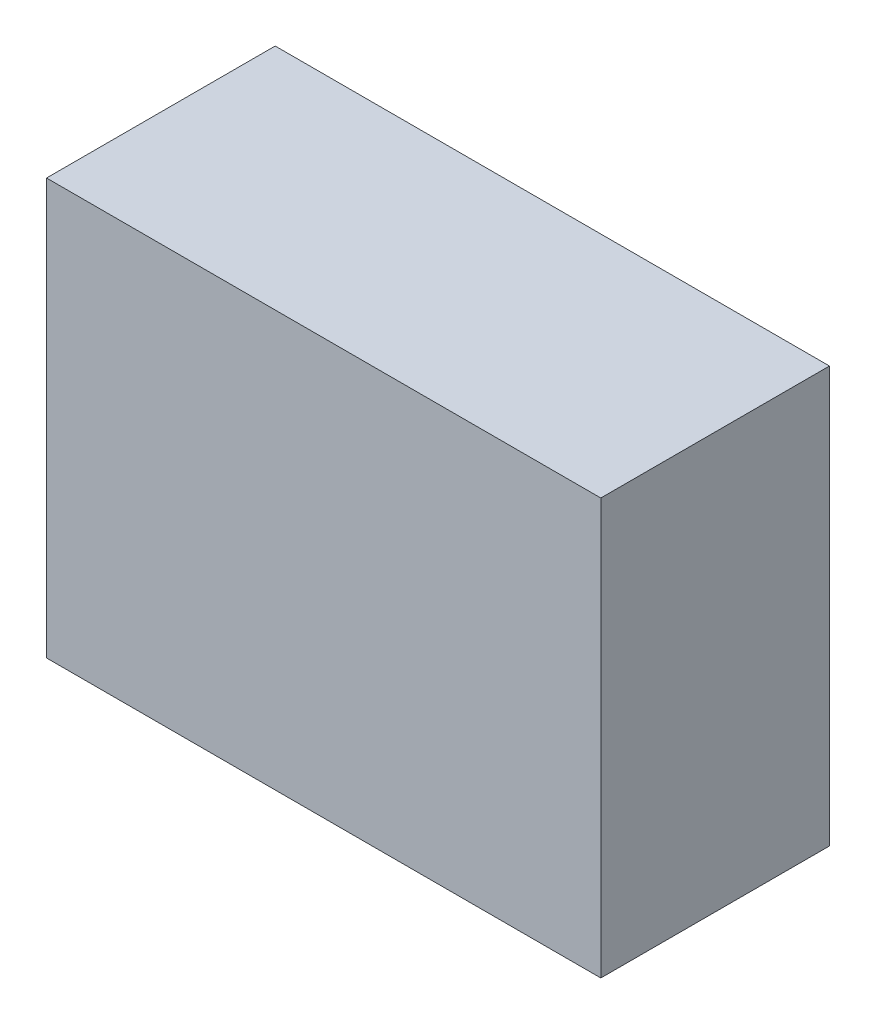
ISO-10303-21;
HEADER;
FILE_DESCRIPTION(('STEP AP214'),'2;1');
FILE_NAME('part.step','',(''),(''),'','','');
FILE_SCHEMA(('AUTOMOTIVE_DESIGN { 1 0 10303 214 1 1 1 1 }'));
ENDSEC;
DATA;
#1=APPLICATION_CONTEXT('core data for automotive mechanical design processes');
#2=APPLICATION_PROTOCOL_DEFINITION('international standard','automotive_design',2000,#1);
#3=PRODUCT_CONTEXT('',#1,'mechanical');
#4=PRODUCT('Part','Part','',(#3));
#5=PRODUCT_RELATED_PRODUCT_CATEGORY('part','',(#4));
#6=PRODUCT_DEFINITION_FORMATION('','',#4);
#7=PRODUCT_DEFINITION_CONTEXT('part definition',#1,'design');
#8=PRODUCT_DEFINITION('design','',#6,#7);
#9=PRODUCT_DEFINITION_SHAPE('','',#8);
#10=(LENGTH_UNIT() NAMED_UNIT(*) SI_UNIT(.MILLI.,.METRE.));
#11=(NAMED_UNIT(*) PLANE_ANGLE_UNIT() SI_UNIT($,.RADIAN.));
#12=(NAMED_UNIT(*) SI_UNIT($,.STERADIAN.) SOLID_ANGLE_UNIT());
#13=UNCERTAINTY_MEASURE_WITH_UNIT(LENGTH_MEASURE(1.E-05),#10,'distance_accuracy_value','');
#14=(GEOMETRIC_REPRESENTATION_CONTEXT(3) GLOBAL_UNCERTAINTY_ASSIGNED_CONTEXT((#13)) GLOBAL_UNIT_ASSIGNED_CONTEXT((#10,
#11,#12)) REPRESENTATION_CONTEXT('',''));
#15=CARTESIAN_POINT('',(0.,0.,0.));
#16=DIRECTION('',(0.,0.,1.));
#17=DIRECTION('',(1.,0.,0.));
#18=AXIS2_PLACEMENT_3D('',#15,#16,#17);
#19=CARTESIAN_POINT('',(-223.516483516483,146.153846153846,165.));
#20=DIRECTION('',(1.,0.,0.));
#21=DIRECTION('',(0.,1.,0.));
#22=AXIS2_PLACEMENT_3D('',#19,#20,#21);
#23=PLANE('',#22);
#24=DIRECTION('',(0.,-1.,0.));
#25=VECTOR('',#24,1.);
#26=CARTESIAN_POINT('',(-223.516483516483,146.153846153846,0.));
#27=LINE('',#26,#25);
#28=CARTESIAN_POINT('',(-223.516483516483,146.153846153846,0.));
#29=VERTEX_POINT('',#28);
#30=CARTESIAN_POINT('',(-223.516483516484,-153.846153846154,0.));
#31=VERTEX_POINT('',#30);
#32=EDGE_CURVE('E107',#29,#31,#27,.T.);
#33=ORIENTED_EDGE('',*,*,#32,.T.);
#34=DIRECTION('',(0.,0.,-1.));
#35=VECTOR('',#34,1.);
#36=CARTESIAN_POINT('',(-223.516483516484,-153.846153846154,165.));
#37=LINE('',#36,#35);
#38=CARTESIAN_POINT('',(-223.516483516484,-153.846153846154,165.));
#39=VERTEX_POINT('',#38);
#40=EDGE_CURVE('E11',#39,#31,#37,.T.);
#41=ORIENTED_EDGE('',*,*,#40,.F.);
#42=DIRECTION('',(0.,-1.,0.));
#43=VECTOR('',#42,1.);
#44=CARTESIAN_POINT('',(-223.516483516483,146.153846153846,165.));
#45=LINE('',#44,#43);
#46=CARTESIAN_POINT('',(-223.516483516483,146.153846153846,165.));
#47=VERTEX_POINT('',#46);
#48=EDGE_CURVE('E91',#47,#39,#45,.T.);
#49=ORIENTED_EDGE('',*,*,#48,.F.);
#50=DIRECTION('',(0.,0.,-1.));
#51=VECTOR('',#50,1.);
#52=CARTESIAN_POINT('',(-223.516483516483,146.153846153846,165.));
#53=LINE('',#52,#51);
#54=EDGE_CURVE('E103',#47,#29,#53,.T.);
#55=ORIENTED_EDGE('',*,*,#54,.T.);
#56=EDGE_LOOP('',(#33,#41,#49,#55));
#57=FACE_BOUND('',#56,.T.);
#58=ADVANCED_FACE('F39',(#57),#23,.F.);
#59=CARTESIAN_POINT('',(-223.516483516484,-153.846153846154,165.));
#60=DIRECTION('',(0.,1.,0.));
#61=DIRECTION('',(0.,0.,1.));
#62=AXIS2_PLACEMENT_3D('',#59,#60,#61);
#63=PLANE('',#62);
#64=DIRECTION('',(1.,0.,0.));
#65=VECTOR('',#64,1.);
#66=CARTESIAN_POINT('',(-223.516483516484,-153.846153846154,0.));
#67=LINE('',#66,#65);
#68=CARTESIAN_POINT('',(176.483516483516,-153.846153846154,0.));
#69=VERTEX_POINT('',#68);
#70=EDGE_CURVE('E96',#31,#69,#67,.T.);
#71=ORIENTED_EDGE('',*,*,#70,.T.);
#72=DIRECTION('',(0.,0.,-1.));
#73=VECTOR('',#72,1.);
#74=CARTESIAN_POINT('',(176.483516483516,-153.846153846154,165.));
#75=LINE('',#74,#73);
#76=CARTESIAN_POINT('',(176.483516483516,-153.846153846154,165.));
#77=VERTEX_POINT('',#76);
#78=EDGE_CURVE('E48',#77,#69,#75,.T.);
#79=ORIENTED_EDGE('',*,*,#78,.F.);
#80=DIRECTION('',(1.,0.,0.));
#81=VECTOR('',#80,1.);
#82=CARTESIAN_POINT('',(-223.516483516484,-153.846153846154,165.));
#83=LINE('',#82,#81);
#84=EDGE_CURVE('E86',#39,#77,#83,.T.);
#85=ORIENTED_EDGE('',*,*,#84,.F.);
#86=ORIENTED_EDGE('',*,*,#40,.T.);
#87=EDGE_LOOP('',(#71,#79,#85,#86));
#88=FACE_BOUND('',#87,.T.);
#89=ADVANCED_FACE('F95',(#88),#63,.F.);
#90=CARTESIAN_POINT('',(176.483516483516,146.153846153846,165.));
#91=DIRECTION('',(-1.,0.,0.));
#92=DIRECTION('',(0.,0.,1.));
#93=AXIS2_PLACEMENT_3D('',#90,#91,#92);
#94=PLANE('',#93);
#95=DIRECTION('',(0.,1.,0.));
#96=VECTOR('',#95,1.);
#97=CARTESIAN_POINT('',(176.483516483516,146.153846153846,0.));
#98=LINE('',#97,#96);
#99=CARTESIAN_POINT('',(176.483516483516,146.153846153846,0.));
#100=VERTEX_POINT('',#99);
#101=EDGE_CURVE('E73',#69,#100,#98,.T.);
#102=ORIENTED_EDGE('',*,*,#101,.T.);
#103=DIRECTION('',(0.,0.,-1.));
#104=VECTOR('',#103,1.);
#105=CARTESIAN_POINT('',(176.483516483516,146.153846153846,165.));
#106=LINE('',#105,#104);
#107=CARTESIAN_POINT('',(176.483516483516,146.153846153846,165.));
#108=VERTEX_POINT('',#107);
#109=EDGE_CURVE('E98',#108,#100,#106,.T.);
#110=ORIENTED_EDGE('',*,*,#109,.F.);
#111=DIRECTION('',(0.,1.,0.));
#112=VECTOR('',#111,1.);
#113=CARTESIAN_POINT('',(176.483516483516,146.153846153846,165.));
#114=LINE('',#113,#112);
#115=EDGE_CURVE('E89',#77,#108,#114,.T.);
#116=ORIENTED_EDGE('',*,*,#115,.F.);
#117=ORIENTED_EDGE('',*,*,#78,.T.);
#118=EDGE_LOOP('',(#102,#110,#116,#117));
#119=FACE_BOUND('',#118,.T.);
#120=ADVANCED_FACE('F99',(#119),#94,.F.);
#121=CARTESIAN_POINT('',(-223.516483516483,146.153846153846,165.));
#122=DIRECTION('',(0.,-1.,0.));
#123=DIRECTION('',(0.,0.,-1.));
#124=AXIS2_PLACEMENT_3D('',#121,#122,#123);
#125=PLANE('',#124);
#126=DIRECTION('',(-1.,0.,0.));
#127=VECTOR('',#126,1.);
#128=CARTESIAN_POINT('',(-223.516483516483,146.153846153846,0.));
#129=LINE('',#128,#127);
#130=EDGE_CURVE('E79',#100,#29,#129,.T.);
#131=ORIENTED_EDGE('',*,*,#130,.T.);
#132=ORIENTED_EDGE('',*,*,#54,.F.);
#133=DIRECTION('',(-1.,0.,0.));
#134=VECTOR('',#133,1.);
#135=CARTESIAN_POINT('',(-223.516483516483,146.153846153846,165.));
#136=LINE('',#135,#134);
#137=EDGE_CURVE('E56',#108,#47,#136,.T.);
#138=ORIENTED_EDGE('',*,*,#137,.F.);
#139=ORIENTED_EDGE('',*,*,#109,.T.);
#140=EDGE_LOOP('',(#131,#132,#138,#139));
#141=FACE_BOUND('',#140,.T.);
#142=ADVANCED_FACE('F120',(#141),#125,.F.);
#143=CARTESIAN_POINT('',(0.,0.,165.));
#144=DIRECTION('',(0.,0.,1.));
#145=DIRECTION('',(1.,0.,0.));
#146=AXIS2_PLACEMENT_3D('',#143,#144,#145);
#147=PLANE('',#146);
#148=ORIENTED_EDGE('',*,*,#48,.T.);
#149=ORIENTED_EDGE('',*,*,#84,.T.);
#150=ORIENTED_EDGE('',*,*,#115,.T.);
#151=ORIENTED_EDGE('',*,*,#137,.T.);
#152=EDGE_LOOP('',(#148,#149,#150,#151));
#153=FACE_BOUND('',#152,.T.);
#154=ADVANCED_FACE('F87',(#153),#147,.T.);
#155=CARTESIAN_POINT('',(0.,0.,0.));
#156=DIRECTION('',(0.,0.,1.));
#157=DIRECTION('',(1.,0.,0.));
#158=AXIS2_PLACEMENT_3D('',#155,#156,#157);
#159=PLANE('',#158);
#160=ORIENTED_EDGE('',*,*,#32,.F.);
#161=ORIENTED_EDGE('',*,*,#130,.F.);
#162=ORIENTED_EDGE('',*,*,#101,.F.);
#163=ORIENTED_EDGE('',*,*,#70,.F.);
#164=EDGE_LOOP('',(#160,#161,#162,#163));
#165=FACE_BOUND('',#164,.T.);
#166=ADVANCED_FACE('F123',(#165),#159,.F.);
#167=CLOSED_SHELL('',(#58,#89,#120,#142,#154,#166));
#168=MANIFOLD_SOLID_BREP('B2',#167);
#169=ADVANCED_BREP_SHAPE_REPRESENTATION('',(#18,#168),#14);
#170=SHAPE_DEFINITION_REPRESENTATION(#9,#169);
ENDSEC;
END-ISO-10303-21;
